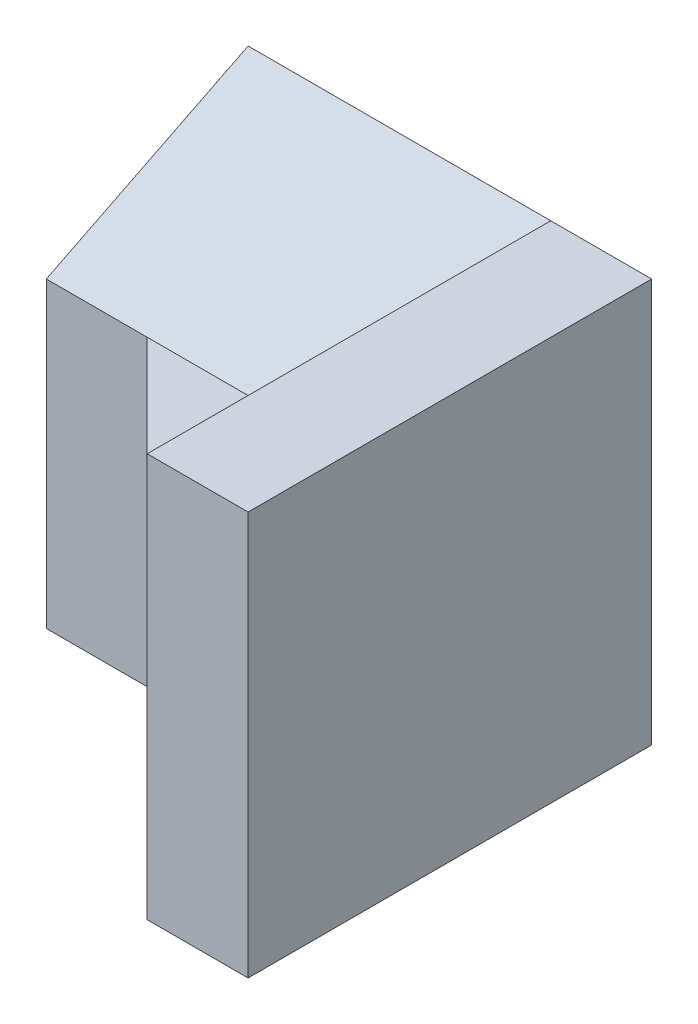
ISO-10303-21;
HEADER;
FILE_DESCRIPTION(('STEP AP214'),'2;1');
FILE_NAME('part.step','',(''),(''),'','','');
FILE_SCHEMA(('AUTOMOTIVE_DESIGN { 1 0 10303 214 1 1 1 1 }'));
ENDSEC;
DATA;
#1=APPLICATION_CONTEXT('core data for automotive mechanical design processes');
#2=APPLICATION_PROTOCOL_DEFINITION('international standard','automotive_design',2000,#1);
#3=PRODUCT_CONTEXT('',#1,'mechanical');
#4=PRODUCT('Part','Part','',(#3));
#5=PRODUCT_RELATED_PRODUCT_CATEGORY('part','',(#4));
#6=PRODUCT_DEFINITION_FORMATION('','',#4);
#7=PRODUCT_DEFINITION_CONTEXT('part definition',#1,'design');
#8=PRODUCT_DEFINITION('design','',#6,#7);
#9=PRODUCT_DEFINITION_SHAPE('','',#8);
#10=(LENGTH_UNIT() NAMED_UNIT(*) SI_UNIT(.MILLI.,.METRE.));
#11=(NAMED_UNIT(*) PLANE_ANGLE_UNIT() SI_UNIT($,.RADIAN.));
#12=(NAMED_UNIT(*) SI_UNIT($,.STERADIAN.) SOLID_ANGLE_UNIT());
#13=UNCERTAINTY_MEASURE_WITH_UNIT(LENGTH_MEASURE(1.E-05),#10,'distance_accuracy_value','');
#14=(GEOMETRIC_REPRESENTATION_CONTEXT(3) GLOBAL_UNCERTAINTY_ASSIGNED_CONTEXT((#13)) GLOBAL_UNIT_ASSIGNED_CONTEXT((#10,
#11,#12)) REPRESENTATION_CONTEXT('',''));
#15=CARTESIAN_POINT('',(0.,0.,0.));
#16=DIRECTION('',(0.,0.,1.));
#17=DIRECTION('',(1.,0.,0.));
#18=AXIS2_PLACEMENT_3D('',#15,#16,#17);
#19=CARTESIAN_POINT('',(3.,0.,0.));
#20=DIRECTION('',(0.,0.,-1.));
#21=DIRECTION('',(-1.,0.,0.));
#22=AXIS2_PLACEMENT_3D('',#19,#20,#21);
#23=PLANE('',#22);
#24=DIRECTION('',(1.,0.,0.));
#25=VECTOR('',#24,1.);
#26=CARTESIAN_POINT('',(1.,1.25873428117984,0.));
#27=LINE('',#26,#25);
#28=CARTESIAN_POINT('',(1.,1.25873428117984,0.));
#29=VERTEX_POINT('',#28);
#30=CARTESIAN_POINT('',(3.,1.25873428117984,0.));
#31=VERTEX_POINT('',#30);
#32=EDGE_CURVE('E176',#29,#31,#27,.T.);
#33=ORIENTED_EDGE('',*,*,#32,.F.);
#34=DIRECTION('',(0.,-1.,0.));
#35=VECTOR('',#34,1.);
#36=CARTESIAN_POINT('',(1.,3.,0.));
#37=LINE('',#36,#35);
#38=CARTESIAN_POINT('',(1.,3.,0.));
#39=VERTEX_POINT('',#38);
#40=EDGE_CURVE('E81',#39,#29,#37,.T.);
#41=ORIENTED_EDGE('',*,*,#40,.F.);
#42=DIRECTION('',(-1.,0.,0.));
#43=VECTOR('',#42,1.);
#44=CARTESIAN_POINT('',(3.,3.,0.));
#45=LINE('',#44,#43);
#46=CARTESIAN_POINT('',(0.,3.,0.));
#47=VERTEX_POINT('',#46);
#48=EDGE_CURVE('E73',#39,#47,#45,.T.);
#49=ORIENTED_EDGE('',*,*,#48,.T.);
#50=DIRECTION('',(0.,-1.,0.));
#51=VECTOR('',#50,1.);
#52=CARTESIAN_POINT('',(0.,0.,0.));
#53=LINE('',#52,#51);
#54=CARTESIAN_POINT('',(0.,0.,0.));
#55=VERTEX_POINT('',#54);
#56=EDGE_CURVE('E78',#47,#55,#53,.T.);
#57=ORIENTED_EDGE('',*,*,#56,.T.);
#58=DIRECTION('',(-1.,0.,0.));
#59=VECTOR('',#58,1.);
#60=CARTESIAN_POINT('',(3.,0.,0.));
#61=LINE('',#60,#59);
#62=CARTESIAN_POINT('',(3.,0.,0.));
#63=VERTEX_POINT('',#62);
#64=EDGE_CURVE('E11',#63,#55,#61,.T.);
#65=ORIENTED_EDGE('',*,*,#64,.F.);
#66=DIRECTION('',(0.,-1.,0.));
#67=VECTOR('',#66,1.);
#68=CARTESIAN_POINT('',(3.,0.,0.));
#69=LINE('',#68,#67);
#70=EDGE_CURVE('E36',#31,#63,#69,.T.);
#71=ORIENTED_EDGE('',*,*,#70,.F.);
#72=EDGE_LOOP('',(#33,#41,#49,#57,#65,#71));
#73=FACE_BOUND('',#72,.T.);
#74=ADVANCED_FACE('F33',(#73),#23,.F.);
#75=CARTESIAN_POINT('',(3.,0.,0.));
#76=DIRECTION('',(-1.,0.,0.));
#77=DIRECTION('',(0.,0.,1.));
#78=AXIS2_PLACEMENT_3D('',#75,#76,#77);
#79=PLANE('',#78);
#80=DIRECTION('',(0.,-1.,0.));
#81=VECTOR('',#80,1.);
#82=CARTESIAN_POINT('',(3.,0.,2.));
#83=LINE('',#82,#81);
#84=CARTESIAN_POINT('',(3.,1.25873428117984,2.));
#85=VERTEX_POINT('',#84);
#86=CARTESIAN_POINT('',(3.,0.,2.));
#87=VERTEX_POINT('',#86);
#88=EDGE_CURVE('E140',#85,#87,#83,.T.);
#89=ORIENTED_EDGE('',*,*,#88,.F.);
#90=DIRECTION('',(0.,0.,1.));
#91=VECTOR('',#90,1.);
#92=CARTESIAN_POINT('',(3.,1.25873428117984,0.));
#93=LINE('',#92,#91);
#94=EDGE_CURVE('E174',#31,#85,#93,.T.);
#95=ORIENTED_EDGE('',*,*,#94,.F.);
#96=ORIENTED_EDGE('',*,*,#70,.T.);
#97=DIRECTION('',(0.,0.,-1.));
#98=VECTOR('',#97,1.);
#99=CARTESIAN_POINT('',(3.,0.,2.));
#100=LINE('',#99,#98);
#101=EDGE_CURVE('E139',#87,#63,#100,.T.);
#102=ORIENTED_EDGE('',*,*,#101,.F.);
#103=EDGE_LOOP('',(#89,#95,#96,#102));
#104=FACE_BOUND('',#103,.T.);
#105=ADVANCED_FACE('F192',(#104),#79,.T.);
#106=DIRECTION('',(0.,-0.447213595499957,0.894427190999917));
#107=VECTOR('',#106,1.);
#108=CARTESIAN_POINT('',(3.,3.,0.));
#109=LINE('',#108,#107);
#110=CARTESIAN_POINT('',(3.,4.,-2.));
#111=VERTEX_POINT('',#110);
#112=CARTESIAN_POINT('',(3.,3.,0.));
#113=VERTEX_POINT('',#112);
#114=EDGE_CURVE('E85',#111,#113,#109,.T.);
#115=ORIENTED_EDGE('',*,*,#114,.T.);
#116=DIRECTION('',(0.,0.,-1.));
#117=VECTOR('',#116,1.);
#118=CARTESIAN_POINT('',(3.,3.,0.));
#119=LINE('',#118,#117);
#120=CARTESIAN_POINT('',(3.,3.,2.));
#121=VERTEX_POINT('',#120);
#122=EDGE_CURVE('E167',#121,#113,#119,.T.);
#123=ORIENTED_EDGE('',*,*,#122,.F.);
#124=CARTESIAN_POINT('',(3.,4.,2.));
#125=VERTEX_POINT('',#124);
#126=EDGE_CURVE('E136',#125,#121,#83,.T.);
#127=ORIENTED_EDGE('',*,*,#126,.F.);
#128=DIRECTION('',(0.,0.,1.));
#129=VECTOR('',#128,1.);
#130=CARTESIAN_POINT('',(3.,4.,2.));
#131=LINE('',#130,#129);
#132=EDGE_CURVE('E130',#111,#125,#131,.T.);
#133=ORIENTED_EDGE('',*,*,#132,.F.);
#134=EDGE_LOOP('',(#115,#123,#127,#133));
#135=FACE_BOUND('',#134,.T.);
#136=ADVANCED_FACE('F165',(#135),#79,.T.);
#137=CARTESIAN_POINT('',(3.,0.,0.));
#138=DIRECTION('',(0.,1.,0.));
#139=DIRECTION('',(0.,0.,1.));
#140=AXIS2_PLACEMENT_3D('',#137,#138,#139);
#141=PLANE('',#140);
#142=DIRECTION('',(0.,0.,-1.));
#143=VECTOR('',#142,1.);
#144=CARTESIAN_POINT('',(0.,0.,0.));
#145=LINE('',#144,#143);
#146=CARTESIAN_POINT('',(0.,0.,-2.));
#147=VERTEX_POINT('',#146);
#148=EDGE_CURVE('E93',#55,#147,#145,.T.);
#149=ORIENTED_EDGE('',*,*,#148,.T.);
#150=DIRECTION('',(-1.,0.,0.));
#151=VECTOR('',#150,1.);
#152=CARTESIAN_POINT('',(3.,0.,-2.));
#153=LINE('',#152,#151);
#154=CARTESIAN_POINT('',(4.,0.,-2.));
#155=VERTEX_POINT('',#154);
#156=EDGE_CURVE('E43',#155,#147,#153,.T.);
#157=ORIENTED_EDGE('',*,*,#156,.F.);
#158=DIRECTION('',(0.,0.,-1.));
#159=VECTOR('',#158,1.);
#160=CARTESIAN_POINT('',(4.,0.,2.));
#161=LINE('',#160,#159);
#162=CARTESIAN_POINT('',(4.,0.,2.));
#163=VERTEX_POINT('',#162);
#164=EDGE_CURVE('E117',#163,#155,#161,.T.);
#165=ORIENTED_EDGE('',*,*,#164,.F.);
#166=DIRECTION('',(-1.,0.,0.));
#167=VECTOR('',#166,1.);
#168=CARTESIAN_POINT('',(4.,0.,2.));
#169=LINE('',#168,#167);
#170=EDGE_CURVE('E94',#163,#87,#169,.T.);
#171=ORIENTED_EDGE('',*,*,#170,.T.);
#172=ORIENTED_EDGE('',*,*,#101,.T.);
#173=ORIENTED_EDGE('',*,*,#64,.T.);
#174=EDGE_LOOP('',(#149,#157,#165,#171,#172,#173));
#175=FACE_BOUND('',#174,.T.);
#176=ADVANCED_FACE('F115',(#175),#141,.F.);
#177=CARTESIAN_POINT('',(3.,0.,-2.));
#178=DIRECTION('',(0.,0.,1.));
#179=DIRECTION('',(0.,-1.,0.));
#180=AXIS2_PLACEMENT_3D('',#177,#178,#179);
#181=PLANE('',#180);
#182=DIRECTION('',(0.,1.,0.));
#183=VECTOR('',#182,1.);
#184=CARTESIAN_POINT('',(0.,0.,-2.));
#185=LINE('',#184,#183);
#186=CARTESIAN_POINT('',(0.,4.,-2.));
#187=VERTEX_POINT('',#186);
#188=EDGE_CURVE('E67',#147,#187,#185,.T.);
#189=ORIENTED_EDGE('',*,*,#188,.T.);
#190=DIRECTION('',(-1.,0.,0.));
#191=VECTOR('',#190,1.);
#192=CARTESIAN_POINT('',(3.,4.,-2.));
#193=LINE('',#192,#191);
#194=EDGE_CURVE('E52',#111,#187,#193,.T.);
#195=ORIENTED_EDGE('',*,*,#194,.F.);
#196=DIRECTION('',(-1.,0.,0.));
#197=VECTOR('',#196,1.);
#198=CARTESIAN_POINT('',(4.,4.,-2.));
#199=LINE('',#198,#197);
#200=CARTESIAN_POINT('',(4.,4.,-2.));
#201=VERTEX_POINT('',#200);
#202=EDGE_CURVE('E98',#201,#111,#199,.T.);
#203=ORIENTED_EDGE('',*,*,#202,.F.);
#204=DIRECTION('',(0.,1.,0.));
#205=VECTOR('',#204,1.);
#206=CARTESIAN_POINT('',(4.,0.,-2.));
#207=LINE('',#206,#205);
#208=EDGE_CURVE('E111',#155,#201,#207,.T.);
#209=ORIENTED_EDGE('',*,*,#208,.F.);
#210=ORIENTED_EDGE('',*,*,#156,.T.);
#211=EDGE_LOOP('',(#189,#195,#203,#209,#210));
#212=FACE_BOUND('',#211,.T.);
#213=ADVANCED_FACE('F108',(#212),#181,.F.);
#214=CARTESIAN_POINT('',(3.,3.,0.));
#215=DIRECTION('',(0.,-0.894427190999917,-0.447213595499957));
#216=DIRECTION('',(0.,0.447213595499957,-0.894427190999917));
#217=AXIS2_PLACEMENT_3D('',#214,#215,#216);
#218=PLANE('',#217);
#219=DIRECTION('',(0.,-0.447213595499957,0.894427190999917));
#220=VECTOR('',#219,1.);
#221=CARTESIAN_POINT('',(0.,3.,0.));
#222=LINE('',#221,#220);
#223=EDGE_CURVE('E88',#187,#47,#222,.T.);
#224=ORIENTED_EDGE('',*,*,#223,.T.);
#225=ORIENTED_EDGE('',*,*,#48,.F.);
#226=EDGE_CURVE('E84',#113,#39,#45,.T.);
#227=ORIENTED_EDGE('',*,*,#226,.F.);
#228=ORIENTED_EDGE('',*,*,#114,.F.);
#229=ORIENTED_EDGE('',*,*,#194,.T.);
#230=EDGE_LOOP('',(#224,#225,#227,#228,#229));
#231=FACE_BOUND('',#230,.T.);
#232=ADVANCED_FACE('F89',(#231),#218,.F.);
#233=CARTESIAN_POINT('',(0.,0.,0.));
#234=DIRECTION('',(-1.,0.,0.));
#235=DIRECTION('',(0.,0.,1.));
#236=AXIS2_PLACEMENT_3D('',#233,#234,#235);
#237=PLANE('',#236);
#238=ORIENTED_EDGE('',*,*,#56,.F.);
#239=ORIENTED_EDGE('',*,*,#223,.F.);
#240=ORIENTED_EDGE('',*,*,#188,.F.);
#241=ORIENTED_EDGE('',*,*,#148,.F.);
#242=EDGE_LOOP('',(#238,#239,#240,#241));
#243=FACE_BOUND('',#242,.T.);
#244=ADVANCED_FACE('F92',(#243),#237,.T.);
#245=CARTESIAN_POINT('',(4.,0.,2.));
#246=DIRECTION('',(0.,0.,-1.));
#247=DIRECTION('',(-1.,0.,0.));
#248=AXIS2_PLACEMENT_3D('',#245,#246,#247);
#249=PLANE('',#248);
#250=ORIENTED_EDGE('',*,*,#126,.T.);
#251=DIRECTION('',(0.,1.,0.));
#252=VECTOR('',#251,1.);
#253=CARTESIAN_POINT('',(3.,1.,2.));
#254=LINE('',#253,#252);
#255=EDGE_CURVE('E189',#85,#121,#254,.T.);
#256=ORIENTED_EDGE('',*,*,#255,.F.);
#257=ORIENTED_EDGE('',*,*,#88,.T.);
#258=ORIENTED_EDGE('',*,*,#170,.F.);
#259=DIRECTION('',(0.,-1.,0.));
#260=VECTOR('',#259,1.);
#261=CARTESIAN_POINT('',(4.,0.,2.));
#262=LINE('',#261,#260);
#263=CARTESIAN_POINT('',(4.,4.,2.));
#264=VERTEX_POINT('',#263);
#265=EDGE_CURVE('E125',#264,#163,#262,.T.);
#266=ORIENTED_EDGE('',*,*,#265,.F.);
#267=DIRECTION('',(-1.,0.,0.));
#268=VECTOR('',#267,1.);
#269=CARTESIAN_POINT('',(4.,4.,2.));
#270=LINE('',#269,#268);
#271=EDGE_CURVE('E135',#264,#125,#270,.T.);
#272=ORIENTED_EDGE('',*,*,#271,.T.);
#273=EDGE_LOOP('',(#250,#256,#257,#258,#266,#272));
#274=FACE_BOUND('',#273,.T.);
#275=ADVANCED_FACE('F154',(#274),#249,.F.);
#276=CARTESIAN_POINT('',(4.,4.,2.));
#277=DIRECTION('',(0.,-1.,0.));
#278=DIRECTION('',(0.,0.,-1.));
#279=AXIS2_PLACEMENT_3D('',#276,#277,#278);
#280=PLANE('',#279);
#281=ORIENTED_EDGE('',*,*,#132,.T.);
#282=ORIENTED_EDGE('',*,*,#271,.F.);
#283=DIRECTION('',(0.,0.,1.));
#284=VECTOR('',#283,1.);
#285=CARTESIAN_POINT('',(4.,4.,2.));
#286=LINE('',#285,#284);
#287=EDGE_CURVE('E128',#201,#264,#286,.T.);
#288=ORIENTED_EDGE('',*,*,#287,.F.);
#289=ORIENTED_EDGE('',*,*,#202,.T.);
#290=EDGE_LOOP('',(#281,#282,#288,#289));
#291=FACE_BOUND('',#290,.T.);
#292=ADVANCED_FACE('F202',(#291),#280,.F.);
#293=CARTESIAN_POINT('',(4.,0.,0.));
#294=DIRECTION('',(-1.,0.,0.));
#295=DIRECTION('',(0.,0.,1.));
#296=AXIS2_PLACEMENT_3D('',#293,#294,#295);
#297=PLANE('',#296);
#298=ORIENTED_EDGE('',*,*,#265,.T.);
#299=ORIENTED_EDGE('',*,*,#164,.T.);
#300=ORIENTED_EDGE('',*,*,#208,.T.);
#301=ORIENTED_EDGE('',*,*,#287,.T.);
#302=EDGE_LOOP('',(#298,#299,#300,#301));
#303=FACE_BOUND('',#302,.T.);
#304=ADVANCED_FACE('F122',(#303),#297,.F.);
#305=CARTESIAN_POINT('',(1.,1.25873428117984,0.));
#306=DIRECTION('',(0.,1.,0.));
#307=DIRECTION('',(0.,0.,1.));
#308=AXIS2_PLACEMENT_3D('',#305,#306,#307);
#309=PLANE('',#308);
#310=ORIENTED_EDGE('',*,*,#94,.T.);
#311=DIRECTION('',(-0.707106781186548,0.,-0.707106781186548));
#312=VECTOR('',#311,1.);
#313=CARTESIAN_POINT('',(1.,1.25873428117984,0.));
#314=LINE('',#313,#312);
#315=EDGE_CURVE('E179',#85,#29,#314,.T.);
#316=ORIENTED_EDGE('',*,*,#315,.T.);
#317=ORIENTED_EDGE('',*,*,#32,.T.);
#318=EDGE_LOOP('',(#310,#316,#317));
#319=FACE_BOUND('',#318,.T.);
#320=ADVANCED_FACE('F209',(#319),#309,.F.);
#321=CARTESIAN_POINT('',(1.,3.,0.));
#322=DIRECTION('',(0.,-1.,0.));
#323=DIRECTION('',(0.,0.,-1.));
#324=AXIS2_PLACEMENT_3D('',#321,#322,#323);
#325=PLANE('',#324);
#326=ORIENTED_EDGE('',*,*,#226,.T.);
#327=DIRECTION('',(-0.707106781186548,0.,-0.707106781186548));
#328=VECTOR('',#327,1.);
#329=CARTESIAN_POINT('',(1.,3.,0.));
#330=LINE('',#329,#328);
#331=EDGE_CURVE('E233',#121,#39,#330,.T.);
#332=ORIENTED_EDGE('',*,*,#331,.F.);
#333=ORIENTED_EDGE('',*,*,#122,.T.);
#334=EDGE_LOOP('',(#326,#332,#333));
#335=FACE_BOUND('',#334,.T.);
#336=ADVANCED_FACE('F223',(#335),#325,.F.);
#337=CARTESIAN_POINT('',(1.,1.,0.));
#338=DIRECTION('',(0.707106781186547,0.,-0.707106781186547));
#339=DIRECTION('',(-0.707106781186548,0.,-0.707106781186548));
#340=AXIS2_PLACEMENT_3D('',#337,#338,#339);
#341=PLANE('',#340);
#342=ORIENTED_EDGE('',*,*,#255,.T.);
#343=ORIENTED_EDGE('',*,*,#331,.T.);
#344=ORIENTED_EDGE('',*,*,#40,.T.);
#345=ORIENTED_EDGE('',*,*,#315,.F.);
#346=EDGE_LOOP('',(#342,#343,#344,#345));
#347=FACE_BOUND('',#346,.T.);
#348=ADVANCED_FACE('F226',(#347),#341,.F.);
#349=CLOSED_SHELL('',(#74,#105,#136,#176,#213,#232,#244,#275,#292,#304,#320,#336,#348));
#350=MANIFOLD_SOLID_BREP('B2',#349);
#351=ADVANCED_BREP_SHAPE_REPRESENTATION('',(#18,#350),#14);
#352=SHAPE_DEFINITION_REPRESENTATION(#9,#351);
ENDSEC;
END-ISO-10303-21;
